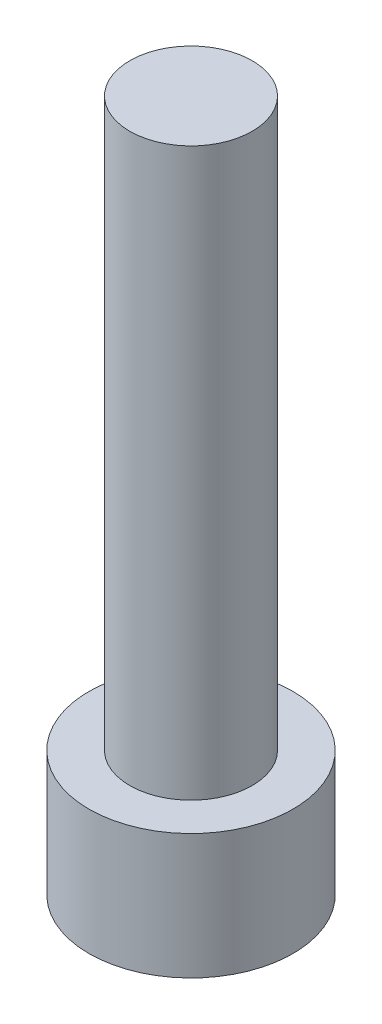
ISO-10303-21;
HEADER;
FILE_DESCRIPTION(('STEP AP214'),'2;1');
FILE_NAME('part.step','',(''),(''),'','','');
FILE_SCHEMA(('AUTOMOTIVE_DESIGN { 1 0 10303 214 1 1 1 1 }'));
ENDSEC;
DATA;
#1=APPLICATION_CONTEXT('core data for automotive mechanical design processes');
#2=APPLICATION_PROTOCOL_DEFINITION('international standard','automotive_design',2000,#1);
#3=PRODUCT_CONTEXT('',#1,'mechanical');
#4=PRODUCT('Part','Part','',(#3));
#5=PRODUCT_RELATED_PRODUCT_CATEGORY('part','',(#4));
#6=PRODUCT_DEFINITION_FORMATION('','',#4);
#7=PRODUCT_DEFINITION_CONTEXT('part definition',#1,'design');
#8=PRODUCT_DEFINITION('design','',#6,#7);
#9=PRODUCT_DEFINITION_SHAPE('','',#8);
#10=(LENGTH_UNIT() NAMED_UNIT(*) SI_UNIT(.MILLI.,.METRE.));
#11=(NAMED_UNIT(*) PLANE_ANGLE_UNIT() SI_UNIT($,.RADIAN.));
#12=(NAMED_UNIT(*) SI_UNIT($,.STERADIAN.) SOLID_ANGLE_UNIT());
#13=UNCERTAINTY_MEASURE_WITH_UNIT(LENGTH_MEASURE(1.E-05),#10,'distance_accuracy_value','');
#14=(GEOMETRIC_REPRESENTATION_CONTEXT(3) GLOBAL_UNCERTAINTY_ASSIGNED_CONTEXT((#13)) GLOBAL_UNIT_ASSIGNED_CONTEXT((#10,
#11,#12)) REPRESENTATION_CONTEXT('',''));
#15=CARTESIAN_POINT('',(0.,0.,0.));
#16=DIRECTION('',(0.,0.,1.));
#17=DIRECTION('',(1.,0.,0.));
#18=AXIS2_PLACEMENT_3D('',#15,#16,#17);
#19=CARTESIAN_POINT('',(0.,3.5052,0.));
#20=DIRECTION('',(0.,1.,0.));
#21=DIRECTION('',(0.,0.,1.));
#22=AXIS2_PLACEMENT_3D('',#19,#20,#21);
#23=PLANE('',#22);
#24=CARTESIAN_POINT('',(0.,3.5052,0.));
#25=DIRECTION('',(0.,1.,0.));
#26=DIRECTION('',(0.,0.,1.));
#27=AXIS2_PLACEMENT_3D('',#24,#25,#26);
#28=CIRCLE('',#27,2.8575);
#29=CARTESIAN_POINT('',(0.,3.5052,2.8575));
#30=VERTEX_POINT('',#29);
#31=EDGE_CURVE('E11',#30,#30,#28,.T.);
#32=ORIENTED_EDGE('',*,*,#31,.T.);
#33=EDGE_LOOP('',(#32));
#34=FACE_BOUND('',#33,.T.);
#35=CARTESIAN_POINT('',(0.,3.5052,0.));
#36=DIRECTION('',(0.,1.,0.));
#37=DIRECTION('',(0.,0.,1.));
#38=AXIS2_PLACEMENT_3D('',#35,#36,#37);
#39=CIRCLE('',#38,1.7145);
#40=CARTESIAN_POINT('',(0.,3.5052,1.7145));
#41=VERTEX_POINT('',#40);
#42=EDGE_CURVE('E152',#41,#41,#39,.T.);
#43=ORIENTED_EDGE('',*,*,#42,.F.);
#44=EDGE_LOOP('',(#43));
#45=FACE_BOUND('',#44,.T.);
#46=ADVANCED_FACE('F33',(#34,#45),#23,.T.);
#47=CARTESIAN_POINT('',(0.,3.5052,0.));
#48=DIRECTION('',(0.,-1.,0.));
#49=DIRECTION('',(0.,0.,-1.));
#50=AXIS2_PLACEMENT_3D('',#47,#48,#49);
#51=CYLINDRICAL_SURFACE('',#50,2.8575);
#52=ORIENTED_EDGE('',*,*,#31,.F.);
#53=EDGE_LOOP('',(#52));
#54=FACE_BOUND('',#53,.T.);
#55=CARTESIAN_POINT('',(0.,0.,0.));
#56=DIRECTION('',(0.,1.,0.));
#57=DIRECTION('',(0.,0.,1.));
#58=AXIS2_PLACEMENT_3D('',#55,#56,#57);
#59=CIRCLE('',#58,2.8575);
#60=CARTESIAN_POINT('',(0.,0.,2.8575));
#61=VERTEX_POINT('',#60);
#62=EDGE_CURVE('E37',#61,#61,#59,.T.);
#63=ORIENTED_EDGE('',*,*,#62,.T.);
#64=EDGE_LOOP('',(#63));
#65=FACE_BOUND('',#64,.T.);
#66=ADVANCED_FACE('F35',(#54,#65),#51,.T.);
#67=CARTESIAN_POINT('',(0.,0.,0.));
#68=DIRECTION('',(0.,1.,0.));
#69=DIRECTION('',(0.,0.,1.));
#70=AXIS2_PLACEMENT_3D('',#67,#68,#69);
#71=PLANE('',#70);
#72=DIRECTION('',(-0.500000000000001,0.,0.866025403784438));
#73=VECTOR('',#72,1.);
#74=CARTESIAN_POINT('',(1.60395121659243,0.,0.));
#75=LINE('',#74,#73);
#76=CARTESIAN_POINT('',(1.60395121659243,0.,0.));
#77=VERTEX_POINT('',#76);
#78=CARTESIAN_POINT('',(0.801975608296214,0.,1.3890625));
#79=VERTEX_POINT('',#78);
#80=EDGE_CURVE('E122',#77,#79,#75,.T.);
#81=ORIENTED_EDGE('',*,*,#80,.F.);
#82=DIRECTION('',(0.5,0.,0.866025403784439));
#83=VECTOR('',#82,1.);
#84=CARTESIAN_POINT('',(0.801975608296215,0.,-1.3890625));
#85=LINE('',#84,#83);
#86=CARTESIAN_POINT('',(0.801975608296215,0.,-1.3890625));
#87=VERTEX_POINT('',#86);
#88=EDGE_CURVE('E48',#87,#77,#85,.T.);
#89=ORIENTED_EDGE('',*,*,#88,.F.);
#90=DIRECTION('',(1.,0.,0.));
#91=VECTOR('',#90,1.);
#92=CARTESIAN_POINT('',(-0.801975608296214,0.,-1.3890625));
#93=LINE('',#92,#91);
#94=CARTESIAN_POINT('',(-0.801975608296214,0.,-1.3890625));
#95=VERTEX_POINT('',#94);
#96=EDGE_CURVE('E132',#95,#87,#93,.T.);
#97=ORIENTED_EDGE('',*,*,#96,.F.);
#98=DIRECTION('',(0.5,0.,-0.866025403784438));
#99=VECTOR('',#98,1.);
#100=CARTESIAN_POINT('',(-1.60395121659243,0.,0.));
#101=LINE('',#100,#99);
#102=CARTESIAN_POINT('',(-1.60395121659243,0.,0.));
#103=VERTEX_POINT('',#102);
#104=EDGE_CURVE('E130',#103,#95,#101,.T.);
#105=ORIENTED_EDGE('',*,*,#104,.F.);
#106=DIRECTION('',(-0.5,0.,-0.866025403784439));
#107=VECTOR('',#106,1.);
#108=CARTESIAN_POINT('',(-0.801975608296214,0.,1.3890625));
#109=LINE('',#108,#107);
#110=CARTESIAN_POINT('',(-0.801975608296214,0.,1.3890625));
#111=VERTEX_POINT('',#110);
#112=EDGE_CURVE('E96',#111,#103,#109,.T.);
#113=ORIENTED_EDGE('',*,*,#112,.F.);
#114=DIRECTION('',(-1.,0.,0.));
#115=VECTOR('',#114,1.);
#116=CARTESIAN_POINT('',(0.801975608296214,0.,1.3890625));
#117=LINE('',#116,#115);
#118=EDGE_CURVE('E126',#79,#111,#117,.T.);
#119=ORIENTED_EDGE('',*,*,#118,.F.);
#120=EDGE_LOOP('',(#81,#89,#97,#105,#113,#119));
#121=FACE_BOUND('',#120,.T.);
#122=ORIENTED_EDGE('',*,*,#62,.F.);
#123=EDGE_LOOP('',(#122));
#124=FACE_BOUND('',#123,.T.);
#125=ADVANCED_FACE('F145',(#121,#124),#71,.F.);
#126=CARTESIAN_POINT('',(0.801975608296215,1.9558,-1.3890625));
#127=DIRECTION('',(0.866025403784438,0.,-0.5));
#128=DIRECTION('',(-0.5,0.,-0.866025403784439));
#129=AXIS2_PLACEMENT_3D('',#126,#127,#128);
#130=PLANE('',#129);
#131=ORIENTED_EDGE('',*,*,#88,.T.);
#132=DIRECTION('',(0.,-1.,0.));
#133=VECTOR('',#132,1.);
#134=CARTESIAN_POINT('',(1.60395121659243,1.9558,0.));
#135=LINE('',#134,#133);
#136=CARTESIAN_POINT('',(1.60395121659243,1.9558,0.));
#137=VERTEX_POINT('',#136);
#138=EDGE_CURVE('E78',#137,#77,#135,.T.);
#139=ORIENTED_EDGE('',*,*,#138,.F.);
#140=DIRECTION('',(0.5,0.,0.866025403784439));
#141=VECTOR('',#140,1.);
#142=CARTESIAN_POINT('',(0.801975608296215,1.9558,-1.3890625));
#143=LINE('',#142,#141);
#144=CARTESIAN_POINT('',(0.801975608296215,1.9558,-1.3890625));
#145=VERTEX_POINT('',#144);
#146=EDGE_CURVE('E134',#145,#137,#143,.T.);
#147=ORIENTED_EDGE('',*,*,#146,.F.);
#148=DIRECTION('',(0.,-1.,0.));
#149=VECTOR('',#148,1.);
#150=CARTESIAN_POINT('',(0.801975608296215,1.9558,-1.3890625));
#151=LINE('',#150,#149);
#152=EDGE_CURVE('E56',#145,#87,#151,.T.);
#153=ORIENTED_EDGE('',*,*,#152,.T.);
#154=EDGE_LOOP('',(#131,#139,#147,#153));
#155=FACE_BOUND('',#154,.T.);
#156=ADVANCED_FACE('F174',(#155),#130,.F.);
#157=CARTESIAN_POINT('',(-0.801975608296214,1.9558,-1.3890625));
#158=DIRECTION('',(0.,0.,-1.));
#159=DIRECTION('',(-1.,0.,0.));
#160=AXIS2_PLACEMENT_3D('',#157,#158,#159);
#161=PLANE('',#160);
#162=ORIENTED_EDGE('',*,*,#96,.T.);
#163=ORIENTED_EDGE('',*,*,#152,.F.);
#164=DIRECTION('',(1.,0.,0.));
#165=VECTOR('',#164,1.);
#166=CARTESIAN_POINT('',(-0.801975608296214,1.9558,-1.3890625));
#167=LINE('',#166,#165);
#168=CARTESIAN_POINT('',(-0.801975608296214,1.9558,-1.3890625));
#169=VERTEX_POINT('',#168);
#170=EDGE_CURVE('E108',#169,#145,#167,.T.);
#171=ORIENTED_EDGE('',*,*,#170,.F.);
#172=DIRECTION('',(0.,-1.,0.));
#173=VECTOR('',#172,1.);
#174=CARTESIAN_POINT('',(-0.801975608296214,1.9558,-1.3890625));
#175=LINE('',#174,#173);
#176=EDGE_CURVE('E100',#169,#95,#175,.T.);
#177=ORIENTED_EDGE('',*,*,#176,.T.);
#178=EDGE_LOOP('',(#162,#163,#171,#177));
#179=FACE_BOUND('',#178,.T.);
#180=ADVANCED_FACE('F180',(#179),#161,.F.);
#181=CARTESIAN_POINT('',(-1.60395121659243,1.9558,0.));
#182=DIRECTION('',(-0.866025403784438,0.,-0.5));
#183=DIRECTION('',(-0.5,0.,0.866025403784439));
#184=AXIS2_PLACEMENT_3D('',#181,#182,#183);
#185=PLANE('',#184);
#186=ORIENTED_EDGE('',*,*,#104,.T.);
#187=ORIENTED_EDGE('',*,*,#176,.F.);
#188=DIRECTION('',(0.5,0.,-0.866025403784438));
#189=VECTOR('',#188,1.);
#190=CARTESIAN_POINT('',(-1.60395121659243,1.9558,0.));
#191=LINE('',#190,#189);
#192=CARTESIAN_POINT('',(-1.60395121659243,1.9558,0.));
#193=VERTEX_POINT('',#192);
#194=EDGE_CURVE('E104',#193,#169,#191,.T.);
#195=ORIENTED_EDGE('',*,*,#194,.F.);
#196=DIRECTION('',(0.,-1.,0.));
#197=VECTOR('',#196,1.);
#198=CARTESIAN_POINT('',(-1.60395121659243,1.9558,0.));
#199=LINE('',#198,#197);
#200=EDGE_CURVE('E89',#193,#103,#199,.T.);
#201=ORIENTED_EDGE('',*,*,#200,.T.);
#202=EDGE_LOOP('',(#186,#187,#195,#201));
#203=FACE_BOUND('',#202,.T.);
#204=ADVANCED_FACE('F105',(#203),#185,.F.);
#205=CARTESIAN_POINT('',(-0.801975608296214,1.9558,1.3890625));
#206=DIRECTION('',(-0.866025403784439,0.,0.5));
#207=DIRECTION('',(0.5,0.,0.866025403784439));
#208=AXIS2_PLACEMENT_3D('',#205,#206,#207);
#209=PLANE('',#208);
#210=ORIENTED_EDGE('',*,*,#112,.T.);
#211=ORIENTED_EDGE('',*,*,#200,.F.);
#212=DIRECTION('',(-0.5,0.,-0.866025403784439));
#213=VECTOR('',#212,1.);
#214=CARTESIAN_POINT('',(-0.801975608296214,1.9558,1.3890625));
#215=LINE('',#214,#213);
#216=CARTESIAN_POINT('',(-0.801975608296214,1.9558,1.3890625));
#217=VERTEX_POINT('',#216);
#218=EDGE_CURVE('E93',#217,#193,#215,.T.);
#219=ORIENTED_EDGE('',*,*,#218,.F.);
#220=DIRECTION('',(0.,-1.,0.));
#221=VECTOR('',#220,1.);
#222=CARTESIAN_POINT('',(-0.801975608296214,1.9558,1.3890625));
#223=LINE('',#222,#221);
#224=EDGE_CURVE('E101',#217,#111,#223,.T.);
#225=ORIENTED_EDGE('',*,*,#224,.T.);
#226=EDGE_LOOP('',(#210,#211,#219,#225));
#227=FACE_BOUND('',#226,.T.);
#228=ADVANCED_FACE('F91',(#227),#209,.F.);
#229=CARTESIAN_POINT('',(0.801975608296214,1.9558,1.3890625));
#230=DIRECTION('',(0.,0.,1.));
#231=DIRECTION('',(1.,0.,0.));
#232=AXIS2_PLACEMENT_3D('',#229,#230,#231);
#233=PLANE('',#232);
#234=ORIENTED_EDGE('',*,*,#118,.T.);
#235=ORIENTED_EDGE('',*,*,#224,.F.);
#236=DIRECTION('',(-1.,0.,0.));
#237=VECTOR('',#236,1.);
#238=CARTESIAN_POINT('',(0.801975608296214,1.9558,1.3890625));
#239=LINE('',#238,#237);
#240=CARTESIAN_POINT('',(0.801975608296214,1.9558,1.3890625));
#241=VERTEX_POINT('',#240);
#242=EDGE_CURVE('E114',#241,#217,#239,.T.);
#243=ORIENTED_EDGE('',*,*,#242,.F.);
#244=DIRECTION('',(0.,-1.,0.));
#245=VECTOR('',#244,1.);
#246=CARTESIAN_POINT('',(0.801975608296214,1.9558,1.3890625));
#247=LINE('',#246,#245);
#248=EDGE_CURVE('E138',#241,#79,#247,.T.);
#249=ORIENTED_EDGE('',*,*,#248,.T.);
#250=EDGE_LOOP('',(#234,#235,#243,#249));
#251=FACE_BOUND('',#250,.T.);
#252=ADVANCED_FACE('F149',(#251),#233,.F.);
#253=CARTESIAN_POINT('',(1.60395121659243,1.9558,0.));
#254=DIRECTION('',(0.866025403784438,0.,0.500000000000001));
#255=DIRECTION('',(0.500000000000001,0.,-0.866025403784438));
#256=AXIS2_PLACEMENT_3D('',#253,#254,#255);
#257=PLANE('',#256);
#258=ORIENTED_EDGE('',*,*,#80,.T.);
#259=ORIENTED_EDGE('',*,*,#248,.F.);
#260=DIRECTION('',(-0.500000000000001,0.,0.866025403784438));
#261=VECTOR('',#260,1.);
#262=CARTESIAN_POINT('',(1.60395121659243,1.9558,0.));
#263=LINE('',#262,#261);
#264=EDGE_CURVE('E116',#137,#241,#263,.T.);
#265=ORIENTED_EDGE('',*,*,#264,.F.);
#266=ORIENTED_EDGE('',*,*,#138,.T.);
#267=EDGE_LOOP('',(#258,#259,#265,#266));
#268=FACE_BOUND('',#267,.T.);
#269=ADVANCED_FACE('F142',(#268),#257,.F.);
#270=CARTESIAN_POINT('',(0.,1.9558,0.));
#271=DIRECTION('',(0.,-1.,0.));
#272=DIRECTION('',(0.,0.,-1.));
#273=AXIS2_PLACEMENT_3D('',#270,#271,#272);
#274=PLANE('',#273);
#275=ORIENTED_EDGE('',*,*,#146,.T.);
#276=ORIENTED_EDGE('',*,*,#264,.T.);
#277=ORIENTED_EDGE('',*,*,#242,.T.);
#278=ORIENTED_EDGE('',*,*,#218,.T.);
#279=ORIENTED_EDGE('',*,*,#194,.T.);
#280=ORIENTED_EDGE('',*,*,#170,.T.);
#281=EDGE_LOOP('',(#275,#276,#277,#278,#279,#280));
#282=FACE_BOUND('',#281,.T.);
#283=ADVANCED_FACE('F111',(#282),#274,.T.);
#284=CARTESIAN_POINT('',(0.,19.3802,0.));
#285=DIRECTION('',(0.,-1.,0.));
#286=DIRECTION('',(0.,0.,-1.));
#287=AXIS2_PLACEMENT_3D('',#284,#285,#286);
#288=CYLINDRICAL_SURFACE('',#287,1.7145);
#289=CARTESIAN_POINT('',(0.,19.3802,0.));
#290=DIRECTION('',(0.,1.,0.));
#291=DIRECTION('',(0.,0.,1.));
#292=AXIS2_PLACEMENT_3D('',#289,#290,#291);
#293=CIRCLE('',#292,1.7145);
#294=CARTESIAN_POINT('',(0.,19.3802,1.7145));
#295=VERTEX_POINT('',#294);
#296=EDGE_CURVE('E123',#295,#295,#293,.T.);
#297=ORIENTED_EDGE('',*,*,#296,.F.);
#298=EDGE_LOOP('',(#297));
#299=FACE_BOUND('',#298,.T.);
#300=ORIENTED_EDGE('',*,*,#42,.T.);
#301=EDGE_LOOP('',(#300));
#302=FACE_BOUND('',#301,.T.);
#303=ADVANCED_FACE('F160',(#299,#302),#288,.T.);
#304=CARTESIAN_POINT('',(0.,19.3802,0.));
#305=DIRECTION('',(0.,1.,0.));
#306=DIRECTION('',(0.,0.,1.));
#307=AXIS2_PLACEMENT_3D('',#304,#305,#306);
#308=PLANE('',#307);
#309=ORIENTED_EDGE('',*,*,#296,.T.);
#310=EDGE_LOOP('',(#309));
#311=FACE_BOUND('',#310,.T.);
#312=ADVANCED_FACE('F158',(#311),#308,.T.);
#313=CLOSED_SHELL('',(#46,#66,#125,#156,#180,#204,#228,#252,#269,#283,#303,#312));
#314=MANIFOLD_SOLID_BREP('B2',#313);
#315=ADVANCED_BREP_SHAPE_REPRESENTATION('',(#18,#314),#14);
#316=SHAPE_DEFINITION_REPRESENTATION(#9,#315);
ENDSEC;
END-ISO-10303-21;
